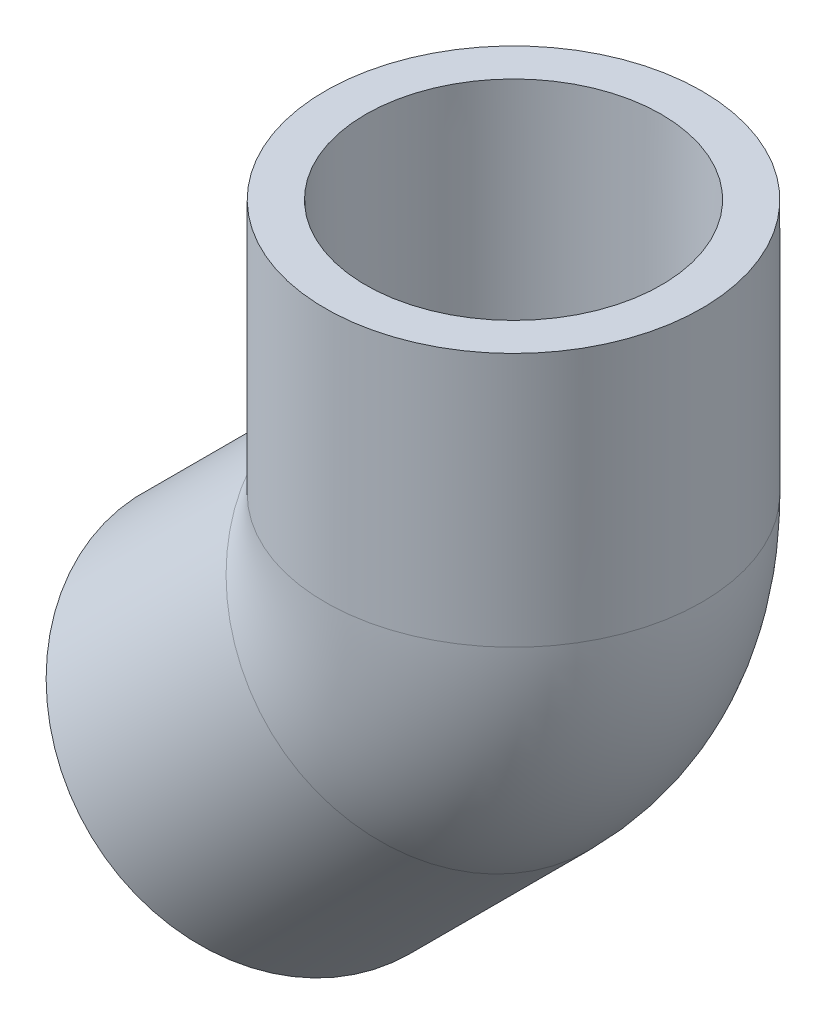
ISO-10303-21;
HEADER;
FILE_DESCRIPTION(('STEP AP214'),'2;1');
FILE_NAME('part.step','',(''),(''),'','','');
FILE_SCHEMA(('AUTOMOTIVE_DESIGN { 1 0 10303 214 1 1 1 1 }'));
ENDSEC;
DATA;
#1=APPLICATION_CONTEXT('core data for automotive mechanical design processes');
#2=APPLICATION_PROTOCOL_DEFINITION('international standard','automotive_design',2000,#1);
#3=PRODUCT_CONTEXT('',#1,'mechanical');
#4=PRODUCT('Part','Part','',(#3));
#5=PRODUCT_RELATED_PRODUCT_CATEGORY('part','',(#4));
#6=PRODUCT_DEFINITION_FORMATION('','',#4);
#7=PRODUCT_DEFINITION_CONTEXT('part definition',#1,'design');
#8=PRODUCT_DEFINITION('design','',#6,#7);
#9=PRODUCT_DEFINITION_SHAPE('','',#8);
#10=(LENGTH_UNIT() NAMED_UNIT(*) SI_UNIT(.MILLI.,.METRE.));
#11=(NAMED_UNIT(*) PLANE_ANGLE_UNIT() SI_UNIT($,.RADIAN.));
#12=(NAMED_UNIT(*) SI_UNIT($,.STERADIAN.) SOLID_ANGLE_UNIT());
#13=UNCERTAINTY_MEASURE_WITH_UNIT(LENGTH_MEASURE(1.E-05),#10,'distance_accuracy_value','');
#14=(GEOMETRIC_REPRESENTATION_CONTEXT(3) GLOBAL_UNCERTAINTY_ASSIGNED_CONTEXT((#13)) GLOBAL_UNIT_ASSIGNED_CONTEXT((#10,
#11,#12)) REPRESENTATION_CONTEXT('',''));
#15=CARTESIAN_POINT('',(0.,0.,0.));
#16=DIRECTION('',(0.,0.,1.));
#17=DIRECTION('',(1.,0.,0.));
#18=AXIS2_PLACEMENT_3D('',#15,#16,#17);
#19=CARTESIAN_POINT('',(-11.7865861589033,-42.0949505675116,0.));
#20=DIRECTION('',(-0.707106781186549,-0.707106781186546,0.));
#21=DIRECTION('',(0.707106781186546,-0.707106781186549,0.));
#22=AXIS2_PLACEMENT_3D('',#19,#20,#21);
#23=PLANE('',#22);
#24=CARTESIAN_POINT('',(-26.9407683632075,-26.9407683632074,0.));
#25=DIRECTION('',(-0.707106781186549,-0.707106781186546,0.));
#26=DIRECTION('',(0.707106781186546,-0.707106781186549,0.));
#27=AXIS2_PLACEMENT_3D('',#24,#25,#26);
#28=CIRCLE('',#27,21.43125);
#29=CARTESIAN_POINT('',(-11.7865861589033,-42.0949505675116,0.));
#30=VERTEX_POINT('',#29);
#31=EDGE_CURVE('E63',#30,#30,#28,.T.);
#32=ORIENTED_EDGE('',*,*,#31,.T.);
#33=EDGE_LOOP('',(#32));
#34=FACE_BOUND('',#33,.T.);
#35=CARTESIAN_POINT('',(-26.9407683632075,-26.9407683632074,0.));
#36=DIRECTION('',(-0.707106781186549,-0.707106781186546,0.));
#37=DIRECTION('',(0.707106781186546,-0.707106781186549,0.));
#38=AXIS2_PLACEMENT_3D('',#35,#36,#37);
#39=CIRCLE('',#38,16.8275);
#40=CARTESIAN_POINT('',(-15.0419290027909,-38.8396077236241,0.));
#41=VERTEX_POINT('',#40);
#42=EDGE_CURVE('E50',#41,#41,#39,.T.);
#43=ORIENTED_EDGE('',*,*,#42,.F.);
#44=EDGE_LOOP('',(#43));
#45=FACE_BOUND('',#44,.T.);
#46=ADVANCED_FACE('F44',(#34,#45),#23,.T.);
#47=CARTESIAN_POINT('',(-6.4657844071698,-6.46578440716978,0.));
#48=DIRECTION('',(-0.707106781186549,-0.707106781186546,0.));
#49=DIRECTION('',(0.707106781186546,-0.707106781186549,0.));
#50=AXIS2_PLACEMENT_3D('',#47,#48,#49);
#51=CONICAL_SURFACE('',#50,16.637,0.00657885245301671);
#52=ORIENTED_EDGE('',*,*,#42,.T.);
#53=EDGE_LOOP('',(#52));
#54=FACE_BOUND('',#53,.T.);
#55=CARTESIAN_POINT('',(-6.4657844071698,-6.46578440716978,0.));
#56=DIRECTION('',(-0.707106781186549,-0.707106781186546,0.));
#57=DIRECTION('',(0.707106781186546,-0.707106781186549,0.));
#58=AXIS2_PLACEMENT_3D('',#55,#56,#57);
#59=CIRCLE('',#58,16.637);
#60=CARTESIAN_POINT('',(5.29835111143076,-18.2299199257704,0.));
#61=VERTEX_POINT('',#60);
#62=EDGE_CURVE('E54',#61,#61,#59,.T.);
#63=ORIENTED_EDGE('',*,*,#62,.F.);
#64=EDGE_LOOP('',(#63));
#65=FACE_BOUND('',#64,.T.);
#66=ADVANCED_FACE('F95',(#54,#65),#51,.F.);
#67=CARTESIAN_POINT('',(-26.9407683632075,-26.9407683632074,0.));
#68=DIRECTION('',(-0.707106781186549,-0.707106781186546,0.));
#69=DIRECTION('',(0.707106781186546,-0.707106781186549,0.));
#70=AXIS2_PLACEMENT_3D('',#67,#68,#69);
#71=CYLINDRICAL_SURFACE('',#70,21.43125);
#72=CARTESIAN_POINT('',(-6.46578440716979,-6.46578440716977,0.));
#73=DIRECTION('',(-0.707106781186549,-0.707106781186546,0.));
#74=DIRECTION('',(0.707106781186546,-0.707106781186549,0.));
#75=AXIS2_PLACEMENT_3D('',#72,#73,#74);
#76=CIRCLE('',#75,21.4312499999999);
#77=CARTESIAN_POINT('',(8.68839779713433,-21.6199666114739,0.));
#78=VERTEX_POINT('',#77);
#79=EDGE_CURVE('E58',#78,#78,#76,.T.);
#80=ORIENTED_EDGE('',*,*,#79,.T.);
#81=EDGE_LOOP('',(#80));
#82=FACE_BOUND('',#81,.T.);
#83=ORIENTED_EDGE('',*,*,#31,.F.);
#84=EDGE_LOOP('',(#83));
#85=FACE_BOUND('',#84,.T.);
#86=ADVANCED_FACE('F100',(#82,#85),#71,.T.);
#87=CARTESIAN_POINT('',(-22.0755688143395,9.14400000000002,0.));
#88=DIRECTION('',(0.,0.,-1.));
#89=DIRECTION('',(-1.,0.,0.));
#90=AXIS2_PLACEMENT_3D('',#87,#88,#89);
#91=TOROIDAL_SURFACE('',#90,22.0755688143396,12.1539);
#92=CARTESIAN_POINT('',(0.,9.14400000000003,0.));
#93=DIRECTION('',(0.,1.,0.));
#94=DIRECTION('',(-1.,0.,0.));
#95=AXIS2_PLACEMENT_3D('',#92,#93,#94);
#96=CIRCLE('',#95,12.1539);
#97=CARTESIAN_POINT('',(12.1539,9.14400000000004,0.));
#98=VERTEX_POINT('',#97);
#99=EDGE_CURVE('E69',#98,#98,#96,.T.);
#100=CARTESIAN_POINT('',(-6.46578440716979,-6.46578440716977,0.));
#101=DIRECTION('',(0.707106781186549,0.707106781186546,0.));
#102=DIRECTION('',(-0.707106781186546,0.707106781186549,0.));
#103=AXIS2_PLACEMENT_3D('',#100,#101,#102);
#104=CIRCLE('',#103,12.1539);
#105=CARTESIAN_POINT('',(2.12832070069338,-15.059889515033,0.));
#106=VERTEX_POINT('',#105);
#107=EDGE_CURVE('E72',#106,#106,#104,.T.);
#108=CARTESIAN_POINT('',(-22.0755688143395,9.14400000000002,0.));
#109=DIRECTION('',(0.,0.,-1.));
#110=DIRECTION('',(-1.,0.,0.));
#111=AXIS2_PLACEMENT_3D('',#108,#109,#110);
#112=CIRCLE('',#111,34.2294688143396);
#113=EDGE_CURVE('',#98,#106,#112,.T.);
#114=ORIENTED_EDGE('',*,*,#99,.T.);
#115=ORIENTED_EDGE('',*,*,#107,.F.);
#116=ORIENTED_EDGE('',*,*,#113,.T.);
#117=ORIENTED_EDGE('',*,*,#113,.F.);
#118=EDGE_LOOP('',(#114,#116,#115,#117));
#119=FACE_BOUND('',#118,.T.);
#120=ADVANCED_FACE('F105',(#119),#91,.F.);
#121=CARTESIAN_POINT('',(-22.0755688143395,9.14400000000002,0.));
#122=DIRECTION('',(0.,0.,-1.));
#123=DIRECTION('',(-1.,0.,0.));
#124=AXIS2_PLACEMENT_3D('',#121,#122,#123);
#125=TOROIDAL_SURFACE('',#124,22.0755688143396,21.4312499999999);
#126=CARTESIAN_POINT('',(0.,9.14400000000003,0.));
#127=DIRECTION('',(0.,1.,0.));
#128=DIRECTION('',(-1.,0.,0.));
#129=AXIS2_PLACEMENT_3D('',#126,#127,#128);
#130=CIRCLE('',#129,21.4312499999999);
#131=CARTESIAN_POINT('',(21.4312499999999,9.14400000000004,0.));
#132=VERTEX_POINT('',#131);
#133=EDGE_CURVE('E66',#132,#132,#130,.T.);
#134=CARTESIAN_POINT('',(-22.0755688143395,9.14400000000002,0.));
#135=DIRECTION('',(0.,0.,-1.));
#136=DIRECTION('',(-1.,0.,0.));
#137=AXIS2_PLACEMENT_3D('',#134,#135,#136);
#138=CIRCLE('',#137,43.5068188143395);
#139=EDGE_CURVE('',#132,#78,#138,.T.);
#140=ORIENTED_EDGE('',*,*,#133,.F.);
#141=ORIENTED_EDGE('',*,*,#79,.F.);
#142=ORIENTED_EDGE('',*,*,#139,.T.);
#143=ORIENTED_EDGE('',*,*,#139,.F.);
#144=EDGE_LOOP('',(#140,#142,#141,#143));
#145=FACE_BOUND('',#144,.T.);
#146=ADVANCED_FACE('F111',(#145),#125,.T.);
#147=CARTESIAN_POINT('',(0.,9.14400000000003,0.));
#148=DIRECTION('',(0.,1.,0.));
#149=DIRECTION('',(-1.,0.,0.));
#150=AXIS2_PLACEMENT_3D('',#147,#148,#149);
#151=PLANE('',#150);
#152=CARTESIAN_POINT('',(0.,9.14400000000003,0.));
#153=DIRECTION('',(0.,1.,0.));
#154=DIRECTION('',(-1.,0.,0.));
#155=AXIS2_PLACEMENT_3D('',#152,#153,#154);
#156=CIRCLE('',#155,16.637);
#157=CARTESIAN_POINT('',(-16.637,9.14400000000003,0.));
#158=VERTEX_POINT('',#157);
#159=EDGE_CURVE('E12',#158,#158,#156,.F.);
#160=ORIENTED_EDGE('',*,*,#159,.F.);
#161=EDGE_LOOP('',(#160));
#162=FACE_BOUND('',#161,.T.);
#163=ORIENTED_EDGE('',*,*,#99,.F.);
#164=EDGE_LOOP('',(#163));
#165=FACE_BOUND('',#164,.T.);
#166=ADVANCED_FACE('F116',(#162,#165),#151,.T.);
#167=CARTESIAN_POINT('',(-6.46578440716979,-6.46578440716977,0.));
#168=DIRECTION('',(0.707106781186549,0.707106781186546,0.));
#169=DIRECTION('',(-0.707106781186546,0.707106781186549,0.));
#170=AXIS2_PLACEMENT_3D('',#167,#168,#169);
#171=PLANE('',#170);
#172=ORIENTED_EDGE('',*,*,#62,.T.);
#173=EDGE_LOOP('',(#172));
#174=FACE_BOUND('',#173,.T.);
#175=ORIENTED_EDGE('',*,*,#107,.T.);
#176=EDGE_LOOP('',(#175));
#177=FACE_BOUND('',#176,.T.);
#178=ADVANCED_FACE('F121',(#174,#177),#171,.F.);
#179=CARTESIAN_POINT('',(21.43125,38.1,0.));
#180=DIRECTION('',(0.,1.,0.));
#181=DIRECTION('',(0.,0.,1.));
#182=AXIS2_PLACEMENT_3D('',#179,#180,#181);
#183=PLANE('',#182);
#184=CARTESIAN_POINT('',(0.,38.1,0.));
#185=DIRECTION('',(0.,-1.,0.));
#186=DIRECTION('',(0.,0.,-1.));
#187=AXIS2_PLACEMENT_3D('',#184,#185,#186);
#188=CIRCLE('',#187,16.8275);
#189=CARTESIAN_POINT('',(0.,38.1,-16.8275));
#190=VERTEX_POINT('',#189);
#191=EDGE_CURVE('E78',#190,#190,#188,.T.);
#192=ORIENTED_EDGE('',*,*,#191,.T.);
#193=EDGE_LOOP('',(#192));
#194=FACE_BOUND('',#193,.T.);
#195=CARTESIAN_POINT('',(0.,38.1,0.));
#196=DIRECTION('',(0.,-1.,0.));
#197=DIRECTION('',(0.,0.,-1.));
#198=AXIS2_PLACEMENT_3D('',#195,#196,#197);
#199=CIRCLE('',#198,21.43125);
#200=CARTESIAN_POINT('',(0.,38.1,-21.43125));
#201=VERTEX_POINT('',#200);
#202=EDGE_CURVE('E75',#201,#201,#199,.T.);
#203=ORIENTED_EDGE('',*,*,#202,.F.);
#204=EDGE_LOOP('',(#203));
#205=FACE_BOUND('',#204,.T.);
#206=ADVANCED_FACE('F82',(#194,#205),#183,.T.);
#207=CARTESIAN_POINT('',(0.,0.,0.));
#208=DIRECTION('',(0.,-1.,0.));
#209=DIRECTION('',(0.,0.,-1.));
#210=AXIS2_PLACEMENT_3D('',#207,#208,#209);
#211=CYLINDRICAL_SURFACE('',#210,21.43125);
#212=ORIENTED_EDGE('',*,*,#202,.T.);
#213=EDGE_LOOP('',(#212));
#214=FACE_BOUND('',#213,.T.);
#215=ORIENTED_EDGE('',*,*,#133,.T.);
#216=EDGE_LOOP('',(#215));
#217=FACE_BOUND('',#216,.T.);
#218=ADVANCED_FACE('F87',(#214,#217),#211,.T.);
#219=CARTESIAN_POINT('',(0.,38.1,0.));
#220=DIRECTION('',(0.,1.,0.));
#221=DIRECTION('',(0.,0.,1.));
#222=AXIS2_PLACEMENT_3D('',#219,#220,#221);
#223=CONICAL_SURFACE('',#222,16.8275,0.00657885245301647);
#224=ORIENTED_EDGE('',*,*,#159,.T.);
#225=EDGE_LOOP('',(#224));
#226=FACE_BOUND('',#225,.T.);
#227=ORIENTED_EDGE('',*,*,#191,.F.);
#228=EDGE_LOOP('',(#227));
#229=FACE_BOUND('',#228,.T.);
#230=ADVANCED_FACE('F85',(#226,#229),#223,.F.);
#231=CLOSED_SHELL('',(#46,#66,#86,#120,#146,#166,#178,#206,#218,#230));
#232=MANIFOLD_SOLID_BREP('B2',#231);
#233=ADVANCED_BREP_SHAPE_REPRESENTATION('',(#18,#232),#14);
#234=SHAPE_DEFINITION_REPRESENTATION(#9,#233);
ENDSEC;
END-ISO-10303-21;
